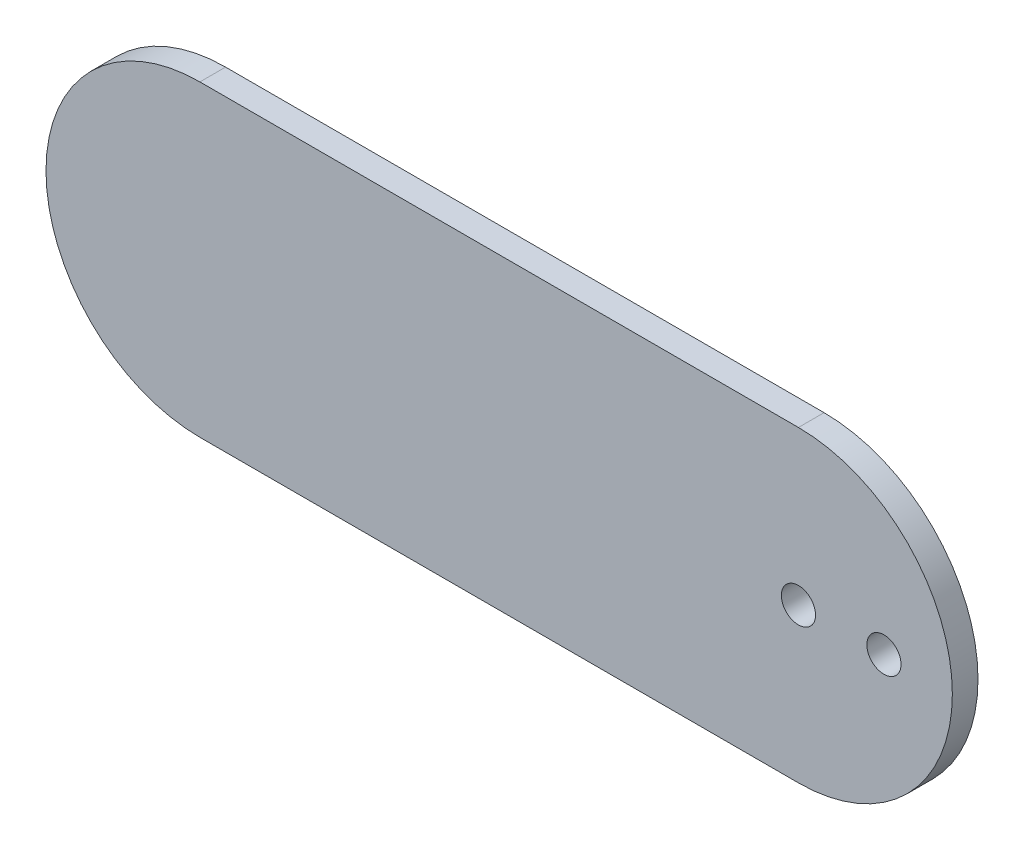
ISO-10303-21;
HEADER;
FILE_DESCRIPTION(('STEP AP214'),'2;1');
FILE_NAME('part.step','',(''),(''),'','','');
FILE_SCHEMA(('AUTOMOTIVE_DESIGN { 1 0 10303 214 1 1 1 1 }'));
ENDSEC;
DATA;
#1=APPLICATION_CONTEXT('core data for automotive mechanical design processes');
#2=APPLICATION_PROTOCOL_DEFINITION('international standard','automotive_design',2000,#1);
#3=PRODUCT_CONTEXT('',#1,'mechanical');
#4=PRODUCT('Part','Part','',(#3));
#5=PRODUCT_RELATED_PRODUCT_CATEGORY('part','',(#4));
#6=PRODUCT_DEFINITION_FORMATION('','',#4);
#7=PRODUCT_DEFINITION_CONTEXT('part definition',#1,'design');
#8=PRODUCT_DEFINITION('design','',#6,#7);
#9=PRODUCT_DEFINITION_SHAPE('','',#8);
#10=(LENGTH_UNIT() NAMED_UNIT(*) SI_UNIT(.MILLI.,.METRE.));
#11=(NAMED_UNIT(*) PLANE_ANGLE_UNIT() SI_UNIT($,.RADIAN.));
#12=(NAMED_UNIT(*) SI_UNIT($,.STERADIAN.) SOLID_ANGLE_UNIT());
#13=UNCERTAINTY_MEASURE_WITH_UNIT(LENGTH_MEASURE(1.E-05),#10,'distance_accuracy_value','');
#14=(GEOMETRIC_REPRESENTATION_CONTEXT(3) GLOBAL_UNCERTAINTY_ASSIGNED_CONTEXT((#13)) GLOBAL_UNIT_ASSIGNED_CONTEXT((#10,
#11,#12)) REPRESENTATION_CONTEXT('',''));
#15=CARTESIAN_POINT('',(0.,0.,0.));
#16=DIRECTION('',(0.,0.,1.));
#17=DIRECTION('',(1.,0.,0.));
#18=AXIS2_PLACEMENT_3D('',#15,#16,#17);
#19=CARTESIAN_POINT('',(-70.,0.,3.));
#20=DIRECTION('',(0.,0.,1.));
#21=DIRECTION('',(1.,0.,0.));
#22=AXIS2_PLACEMENT_3D('',#19,#20,#21);
#23=PLANE('',#22);
#24=CARTESIAN_POINT('',(10.,0.,3.));
#25=DIRECTION('',(0.,0.,1.));
#26=DIRECTION('',(1.,0.,0.));
#27=AXIS2_PLACEMENT_3D('',#24,#25,#26);
#28=CIRCLE('',#27,2.);
#29=CARTESIAN_POINT('',(12.,0.,3.));
#30=VERTEX_POINT('',#29);
#31=EDGE_CURVE('E118',#30,#30,#28,.T.);
#32=ORIENTED_EDGE('',*,*,#31,.F.);
#33=EDGE_LOOP('',(#32));
#34=FACE_BOUND('',#33,.T.);
#35=CARTESIAN_POINT('',(-70.,0.,3.));
#36=DIRECTION('',(0.,0.,1.));
#37=DIRECTION('',(1.,0.,0.));
#38=AXIS2_PLACEMENT_3D('',#35,#36,#37);
#39=CIRCLE('',#38,18.);
#40=CARTESIAN_POINT('',(-70.,18.,3.));
#41=VERTEX_POINT('',#40);
#42=CARTESIAN_POINT('',(-70.,-18.,3.));
#43=VERTEX_POINT('',#42);
#44=EDGE_CURVE('E85',#41,#43,#39,.T.);
#45=ORIENTED_EDGE('',*,*,#44,.T.);
#46=DIRECTION('',(1.,0.,0.));
#47=VECTOR('',#46,1.);
#48=CARTESIAN_POINT('',(0.,-18.,3.));
#49=LINE('',#48,#47);
#50=CARTESIAN_POINT('',(0.,-18.,3.));
#51=VERTEX_POINT('',#50);
#52=EDGE_CURVE('E80',#43,#51,#49,.T.);
#53=ORIENTED_EDGE('',*,*,#52,.T.);
#54=CARTESIAN_POINT('',(0.,0.,3.));
#55=DIRECTION('',(0.,0.,1.));
#56=DIRECTION('',(1.,0.,0.));
#57=AXIS2_PLACEMENT_3D('',#54,#55,#56);
#58=CIRCLE('',#57,18.);
#59=CARTESIAN_POINT('',(0.,18.,3.));
#60=VERTEX_POINT('',#59);
#61=EDGE_CURVE('E83',#51,#60,#58,.T.);
#62=ORIENTED_EDGE('',*,*,#61,.T.);
#63=DIRECTION('',(-1.,0.,0.));
#64=VECTOR('',#63,1.);
#65=CARTESIAN_POINT('',(0.,18.,3.));
#66=LINE('',#65,#64);
#67=EDGE_CURVE('E50',#60,#41,#66,.T.);
#68=ORIENTED_EDGE('',*,*,#67,.T.);
#69=EDGE_LOOP('',(#45,#53,#62,#68));
#70=FACE_BOUND('',#69,.T.);
#71=CARTESIAN_POINT('',(0.,0.,3.));
#72=DIRECTION('',(0.,0.,1.));
#73=DIRECTION('',(1.,0.,0.));
#74=AXIS2_PLACEMENT_3D('',#71,#72,#73);
#75=CIRCLE('',#74,2.);
#76=CARTESIAN_POINT('',(2.,0.,3.));
#77=VERTEX_POINT('',#76);
#78=EDGE_CURVE('E100',#77,#77,#75,.T.);
#79=ORIENTED_EDGE('',*,*,#78,.F.);
#80=EDGE_LOOP('',(#79));
#81=FACE_BOUND('',#80,.T.);
#82=ADVANCED_FACE('F33',(#34,#70,#81),#23,.T.);
#83=CARTESIAN_POINT('',(-70.,0.,0.));
#84=DIRECTION('',(0.,0.,1.));
#85=DIRECTION('',(1.,0.,0.));
#86=AXIS2_PLACEMENT_3D('',#83,#84,#85);
#87=PLANE('',#86);
#88=CARTESIAN_POINT('',(10.,0.,0.));
#89=DIRECTION('',(0.,0.,1.));
#90=DIRECTION('',(1.,0.,0.));
#91=AXIS2_PLACEMENT_3D('',#88,#89,#90);
#92=CIRCLE('',#91,2.);
#93=CARTESIAN_POINT('',(12.,0.,0.));
#94=VERTEX_POINT('',#93);
#95=EDGE_CURVE('E115',#94,#94,#92,.T.);
#96=ORIENTED_EDGE('',*,*,#95,.T.);
#97=EDGE_LOOP('',(#96));
#98=FACE_BOUND('',#97,.T.);
#99=CARTESIAN_POINT('',(-70.,0.,0.));
#100=DIRECTION('',(0.,0.,1.));
#101=DIRECTION('',(1.,0.,0.));
#102=AXIS2_PLACEMENT_3D('',#99,#100,#101);
#103=CIRCLE('',#102,18.);
#104=CARTESIAN_POINT('',(-70.,18.,0.));
#105=VERTEX_POINT('',#104);
#106=CARTESIAN_POINT('',(-70.,-18.,0.));
#107=VERTEX_POINT('',#106);
#108=EDGE_CURVE('E97',#105,#107,#103,.T.);
#109=ORIENTED_EDGE('',*,*,#108,.F.);
#110=DIRECTION('',(-1.,0.,0.));
#111=VECTOR('',#110,1.);
#112=CARTESIAN_POINT('',(0.,18.,0.));
#113=LINE('',#112,#111);
#114=CARTESIAN_POINT('',(0.,18.,0.));
#115=VERTEX_POINT('',#114);
#116=EDGE_CURVE('E73',#115,#105,#113,.T.);
#117=ORIENTED_EDGE('',*,*,#116,.F.);
#118=CARTESIAN_POINT('',(0.,0.,0.));
#119=DIRECTION('',(0.,0.,1.));
#120=DIRECTION('',(1.,0.,0.));
#121=AXIS2_PLACEMENT_3D('',#118,#119,#120);
#122=CIRCLE('',#121,18.);
#123=CARTESIAN_POINT('',(0.,-18.,0.));
#124=VERTEX_POINT('',#123);
#125=EDGE_CURVE('E67',#124,#115,#122,.T.);
#126=ORIENTED_EDGE('',*,*,#125,.F.);
#127=DIRECTION('',(1.,0.,0.));
#128=VECTOR('',#127,1.);
#129=CARTESIAN_POINT('',(0.,-18.,0.));
#130=LINE('',#129,#128);
#131=EDGE_CURVE('E89',#107,#124,#130,.T.);
#132=ORIENTED_EDGE('',*,*,#131,.F.);
#133=EDGE_LOOP('',(#109,#117,#126,#132));
#134=FACE_BOUND('',#133,.T.);
#135=CARTESIAN_POINT('',(0.,0.,0.));
#136=DIRECTION('',(0.,0.,1.));
#137=DIRECTION('',(1.,0.,0.));
#138=AXIS2_PLACEMENT_3D('',#135,#136,#137);
#139=CIRCLE('',#138,2.);
#140=CARTESIAN_POINT('',(2.,0.,0.));
#141=VERTEX_POINT('',#140);
#142=EDGE_CURVE('E112',#141,#141,#139,.T.);
#143=ORIENTED_EDGE('',*,*,#142,.T.);
#144=EDGE_LOOP('',(#143));
#145=FACE_BOUND('',#144,.T.);
#146=ADVANCED_FACE('F108',(#98,#134,#145),#87,.F.);
#147=CARTESIAN_POINT('',(-70.,0.,3.));
#148=DIRECTION('',(0.,0.,-1.));
#149=DIRECTION('',(-1.,0.,0.));
#150=AXIS2_PLACEMENT_3D('',#147,#148,#149);
#151=CYLINDRICAL_SURFACE('',#150,18.);
#152=ORIENTED_EDGE('',*,*,#108,.T.);
#153=DIRECTION('',(0.,0.,-1.));
#154=VECTOR('',#153,1.);
#155=CARTESIAN_POINT('',(-70.,-18.,3.));
#156=LINE('',#155,#154);
#157=EDGE_CURVE('E11',#43,#107,#156,.T.);
#158=ORIENTED_EDGE('',*,*,#157,.F.);
#159=ORIENTED_EDGE('',*,*,#44,.F.);
#160=DIRECTION('',(0.,0.,-1.));
#161=VECTOR('',#160,1.);
#162=CARTESIAN_POINT('',(-70.,18.,3.));
#163=LINE('',#162,#161);
#164=EDGE_CURVE('E93',#41,#105,#163,.T.);
#165=ORIENTED_EDGE('',*,*,#164,.T.);
#166=EDGE_LOOP('',(#152,#158,#159,#165));
#167=FACE_BOUND('',#166,.T.);
#168=ADVANCED_FACE('F35',(#167),#151,.T.);
#169=CARTESIAN_POINT('',(0.,-18.,3.));
#170=DIRECTION('',(0.,1.,0.));
#171=DIRECTION('',(-1.,0.,0.));
#172=AXIS2_PLACEMENT_3D('',#169,#170,#171);
#173=PLANE('',#172);
#174=ORIENTED_EDGE('',*,*,#131,.T.);
#175=DIRECTION('',(0.,0.,-1.));
#176=VECTOR('',#175,1.);
#177=CARTESIAN_POINT('',(0.,-18.,3.));
#178=LINE('',#177,#176);
#179=EDGE_CURVE('E42',#51,#124,#178,.T.);
#180=ORIENTED_EDGE('',*,*,#179,.F.);
#181=ORIENTED_EDGE('',*,*,#52,.F.);
#182=ORIENTED_EDGE('',*,*,#157,.T.);
#183=EDGE_LOOP('',(#174,#180,#181,#182));
#184=FACE_BOUND('',#183,.T.);
#185=ADVANCED_FACE('F88',(#184),#173,.F.);
#186=CARTESIAN_POINT('',(0.,0.,3.));
#187=DIRECTION('',(0.,0.,-1.));
#188=DIRECTION('',(-1.,0.,0.));
#189=AXIS2_PLACEMENT_3D('',#186,#187,#188);
#190=CYLINDRICAL_SURFACE('',#189,18.);
#191=ORIENTED_EDGE('',*,*,#125,.T.);
#192=DIRECTION('',(0.,0.,-1.));
#193=VECTOR('',#192,1.);
#194=CARTESIAN_POINT('',(0.,18.,3.));
#195=LINE('',#194,#193);
#196=EDGE_CURVE('E90',#60,#115,#195,.T.);
#197=ORIENTED_EDGE('',*,*,#196,.F.);
#198=ORIENTED_EDGE('',*,*,#61,.F.);
#199=ORIENTED_EDGE('',*,*,#179,.T.);
#200=EDGE_LOOP('',(#191,#197,#198,#199));
#201=FACE_BOUND('',#200,.T.);
#202=ADVANCED_FACE('F91',(#201),#190,.T.);
#203=CARTESIAN_POINT('',(0.,18.,3.));
#204=DIRECTION('',(0.,-1.,0.));
#205=DIRECTION('',(1.,0.,0.));
#206=AXIS2_PLACEMENT_3D('',#203,#204,#205);
#207=PLANE('',#206);
#208=ORIENTED_EDGE('',*,*,#116,.T.);
#209=ORIENTED_EDGE('',*,*,#164,.F.);
#210=ORIENTED_EDGE('',*,*,#67,.F.);
#211=ORIENTED_EDGE('',*,*,#196,.T.);
#212=EDGE_LOOP('',(#208,#209,#210,#211));
#213=FACE_BOUND('',#212,.T.);
#214=ADVANCED_FACE('F105',(#213),#207,.F.);
#215=CARTESIAN_POINT('',(0.,0.,3.));
#216=DIRECTION('',(0.,0.,-1.));
#217=DIRECTION('',(-1.,0.,0.));
#218=AXIS2_PLACEMENT_3D('',#215,#216,#217);
#219=CYLINDRICAL_SURFACE('',#218,2.);
#220=ORIENTED_EDGE('',*,*,#78,.T.);
#221=EDGE_LOOP('',(#220));
#222=FACE_BOUND('',#221,.T.);
#223=ORIENTED_EDGE('',*,*,#142,.F.);
#224=EDGE_LOOP('',(#223));
#225=FACE_BOUND('',#224,.T.);
#226=ADVANCED_FACE('F128',(#222,#225),#219,.F.);
#227=CARTESIAN_POINT('',(10.,0.,0.));
#228=DIRECTION('',(0.,0.,1.));
#229=DIRECTION('',(1.,0.,0.));
#230=AXIS2_PLACEMENT_3D('',#227,#228,#229);
#231=CYLINDRICAL_SURFACE('',#230,2.);
#232=ORIENTED_EDGE('',*,*,#95,.F.);
#233=EDGE_LOOP('',(#232));
#234=FACE_BOUND('',#233,.T.);
#235=ORIENTED_EDGE('',*,*,#31,.T.);
#236=EDGE_LOOP('',(#235));
#237=FACE_BOUND('',#236,.T.);
#238=ADVANCED_FACE('F125',(#234,#237),#231,.F.);
#239=CLOSED_SHELL('',(#82,#146,#168,#185,#202,#214,#226,#238));
#240=MANIFOLD_SOLID_BREP('B2',#239);
#241=ADVANCED_BREP_SHAPE_REPRESENTATION('',(#18,#240),#14);
#242=SHAPE_DEFINITION_REPRESENTATION(#9,#241);
ENDSEC;
END-ISO-10303-21;
